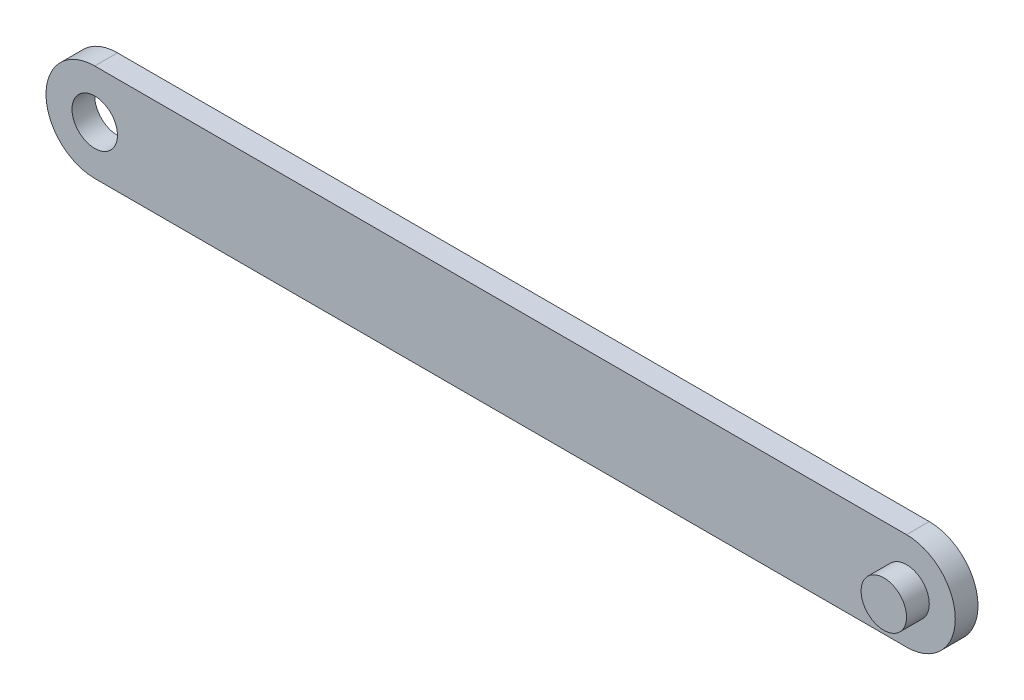
ISO-10303-21;
HEADER;
FILE_DESCRIPTION(('STEP AP214'),'2;1');
FILE_NAME('part.step','',(''),(''),'','','');
FILE_SCHEMA(('AUTOMOTIVE_DESIGN { 1 0 10303 214 1 1 1 1 }'));
ENDSEC;
DATA;
#1=APPLICATION_CONTEXT('core data for automotive mechanical design processes');
#2=APPLICATION_PROTOCOL_DEFINITION('international standard','automotive_design',2000,#1);
#3=PRODUCT_CONTEXT('',#1,'mechanical');
#4=PRODUCT('Part','Part','',(#3));
#5=PRODUCT_RELATED_PRODUCT_CATEGORY('part','',(#4));
#6=PRODUCT_DEFINITION_FORMATION('','',#4);
#7=PRODUCT_DEFINITION_CONTEXT('part definition',#1,'design');
#8=PRODUCT_DEFINITION('design','',#6,#7);
#9=PRODUCT_DEFINITION_SHAPE('','',#8);
#10=(LENGTH_UNIT() NAMED_UNIT(*) SI_UNIT(.MILLI.,.METRE.));
#11=(NAMED_UNIT(*) PLANE_ANGLE_UNIT() SI_UNIT($,.RADIAN.));
#12=(NAMED_UNIT(*) SI_UNIT($,.STERADIAN.) SOLID_ANGLE_UNIT());
#13=UNCERTAINTY_MEASURE_WITH_UNIT(LENGTH_MEASURE(1.E-05),#10,'distance_accuracy_value','');
#14=(GEOMETRIC_REPRESENTATION_CONTEXT(3) GLOBAL_UNCERTAINTY_ASSIGNED_CONTEXT((#13)) GLOBAL_UNIT_ASSIGNED_CONTEXT((#10,
#11,#12)) REPRESENTATION_CONTEXT('',''));
#15=CARTESIAN_POINT('',(0.,0.,0.));
#16=DIRECTION('',(0.,0.,1.));
#17=DIRECTION('',(1.,0.,0.));
#18=AXIS2_PLACEMENT_3D('',#15,#16,#17);
#19=CARTESIAN_POINT('',(-125.,0.,7.));
#20=DIRECTION('',(0.,0.,-1.));
#21=DIRECTION('',(-1.,0.,0.));
#22=AXIS2_PLACEMENT_3D('',#19,#20,#21);
#23=CYLINDRICAL_SURFACE('',#22,15.);
#24=CARTESIAN_POINT('',(-125.,0.,0.));
#25=DIRECTION('',(0.,0.,1.));
#26=DIRECTION('',(1.,0.,0.));
#27=AXIS2_PLACEMENT_3D('',#24,#25,#26);
#28=CIRCLE('',#27,15.);
#29=CARTESIAN_POINT('',(-125.,15.,0.));
#30=VERTEX_POINT('',#29);
#31=CARTESIAN_POINT('',(-125.,-15.,0.));
#32=VERTEX_POINT('',#31);
#33=EDGE_CURVE('E96',#30,#32,#28,.T.);
#34=ORIENTED_EDGE('',*,*,#33,.T.);
#35=DIRECTION('',(0.,0.,-1.));
#36=VECTOR('',#35,1.);
#37=CARTESIAN_POINT('',(-125.,-15.,7.));
#38=LINE('',#37,#36);
#39=CARTESIAN_POINT('',(-125.,-15.,7.));
#40=VERTEX_POINT('',#39);
#41=EDGE_CURVE('E11',#40,#32,#38,.T.);
#42=ORIENTED_EDGE('',*,*,#41,.F.);
#43=CARTESIAN_POINT('',(-125.,0.,7.));
#44=DIRECTION('',(0.,0.,1.));
#45=DIRECTION('',(1.,0.,0.));
#46=AXIS2_PLACEMENT_3D('',#43,#44,#45);
#47=CIRCLE('',#46,15.);
#48=CARTESIAN_POINT('',(-125.,15.,7.));
#49=VERTEX_POINT('',#48);
#50=EDGE_CURVE('E84',#49,#40,#47,.T.);
#51=ORIENTED_EDGE('',*,*,#50,.F.);
#52=DIRECTION('',(0.,0.,-1.));
#53=VECTOR('',#52,1.);
#54=CARTESIAN_POINT('',(-125.,15.,7.));
#55=LINE('',#54,#53);
#56=EDGE_CURVE('E92',#49,#30,#55,.T.);
#57=ORIENTED_EDGE('',*,*,#56,.T.);
#58=EDGE_LOOP('',(#34,#42,#51,#57));
#59=FACE_BOUND('',#58,.T.);
#60=ADVANCED_FACE('F33',(#59),#23,.T.);
#61=CARTESIAN_POINT('',(-125.,-15.,7.));
#62=DIRECTION('',(0.,1.,0.));
#63=DIRECTION('',(-1.,0.,0.));
#64=AXIS2_PLACEMENT_3D('',#61,#62,#63);
#65=PLANE('',#64);
#66=DIRECTION('',(1.,0.,0.));
#67=VECTOR('',#66,1.);
#68=CARTESIAN_POINT('',(-125.,-15.,0.));
#69=LINE('',#68,#67);
#70=CARTESIAN_POINT('',(125.,-15.,0.));
#71=VERTEX_POINT('',#70);
#72=EDGE_CURVE('E88',#32,#71,#69,.T.);
#73=ORIENTED_EDGE('',*,*,#72,.T.);
#74=DIRECTION('',(0.,0.,-1.));
#75=VECTOR('',#74,1.);
#76=CARTESIAN_POINT('',(125.,-15.,7.));
#77=LINE('',#76,#75);
#78=CARTESIAN_POINT('',(125.,-15.,7.));
#79=VERTEX_POINT('',#78);
#80=EDGE_CURVE('E41',#79,#71,#77,.T.);
#81=ORIENTED_EDGE('',*,*,#80,.F.);
#82=DIRECTION('',(1.,0.,0.));
#83=VECTOR('',#82,1.);
#84=CARTESIAN_POINT('',(-125.,-15.,7.));
#85=LINE('',#84,#83);
#86=EDGE_CURVE('E79',#40,#79,#85,.T.);
#87=ORIENTED_EDGE('',*,*,#86,.F.);
#88=ORIENTED_EDGE('',*,*,#41,.T.);
#89=EDGE_LOOP('',(#73,#81,#87,#88));
#90=FACE_BOUND('',#89,.T.);
#91=ADVANCED_FACE('F87',(#90),#65,.F.);
#92=CARTESIAN_POINT('',(125.,0.,7.));
#93=DIRECTION('',(0.,0.,-1.));
#94=DIRECTION('',(-1.,0.,0.));
#95=AXIS2_PLACEMENT_3D('',#92,#93,#94);
#96=CYLINDRICAL_SURFACE('',#95,15.);
#97=CARTESIAN_POINT('',(125.,0.,0.));
#98=DIRECTION('',(0.,0.,1.));
#99=DIRECTION('',(1.,0.,0.));
#100=AXIS2_PLACEMENT_3D('',#97,#98,#99);
#101=CIRCLE('',#100,15.);
#102=CARTESIAN_POINT('',(125.,15.,0.));
#103=VERTEX_POINT('',#102);
#104=EDGE_CURVE('E66',#71,#103,#101,.T.);
#105=ORIENTED_EDGE('',*,*,#104,.T.);
#106=DIRECTION('',(0.,0.,-1.));
#107=VECTOR('',#106,1.);
#108=CARTESIAN_POINT('',(125.,15.,7.));
#109=LINE('',#108,#107);
#110=CARTESIAN_POINT('',(125.,15.,7.));
#111=VERTEX_POINT('',#110);
#112=EDGE_CURVE('E89',#111,#103,#109,.T.);
#113=ORIENTED_EDGE('',*,*,#112,.F.);
#114=CARTESIAN_POINT('',(125.,0.,7.));
#115=DIRECTION('',(0.,0.,1.));
#116=DIRECTION('',(1.,0.,0.));
#117=AXIS2_PLACEMENT_3D('',#114,#115,#116);
#118=CIRCLE('',#117,15.);
#119=EDGE_CURVE('E82',#79,#111,#118,.T.);
#120=ORIENTED_EDGE('',*,*,#119,.F.);
#121=ORIENTED_EDGE('',*,*,#80,.T.);
#122=EDGE_LOOP('',(#105,#113,#120,#121));
#123=FACE_BOUND('',#122,.T.);
#124=ADVANCED_FACE('F90',(#123),#96,.T.);
#125=CARTESIAN_POINT('',(-125.,15.,7.));
#126=DIRECTION('',(0.,-1.,0.));
#127=DIRECTION('',(0.,0.,-1.));
#128=AXIS2_PLACEMENT_3D('',#125,#126,#127);
#129=PLANE('',#128);
#130=DIRECTION('',(-1.,0.,0.));
#131=VECTOR('',#130,1.);
#132=CARTESIAN_POINT('',(-125.,15.,0.));
#133=LINE('',#132,#131);
#134=EDGE_CURVE('E72',#103,#30,#133,.T.);
#135=ORIENTED_EDGE('',*,*,#134,.T.);
#136=ORIENTED_EDGE('',*,*,#56,.F.);
#137=DIRECTION('',(-1.,0.,0.));
#138=VECTOR('',#137,1.);
#139=CARTESIAN_POINT('',(-125.,15.,7.));
#140=LINE('',#139,#138);
#141=EDGE_CURVE('E49',#111,#49,#140,.T.);
#142=ORIENTED_EDGE('',*,*,#141,.F.);
#143=ORIENTED_EDGE('',*,*,#112,.T.);
#144=EDGE_LOOP('',(#135,#136,#142,#143));
#145=FACE_BOUND('',#144,.T.);
#146=ADVANCED_FACE('F104',(#145),#129,.F.);
#147=CARTESIAN_POINT('',(-125.,0.,7.));
#148=DIRECTION('',(0.,0.,1.));
#149=DIRECTION('',(1.,0.,0.));
#150=AXIS2_PLACEMENT_3D('',#147,#148,#149);
#151=PLANE('',#150);
#152=CARTESIAN_POINT('',(-125.,0.,7.));
#153=DIRECTION('',(0.,0.,1.));
#154=DIRECTION('',(1.,0.,0.));
#155=AXIS2_PLACEMENT_3D('',#152,#153,#154);
#156=CIRCLE('',#155,7.);
#157=CARTESIAN_POINT('',(-118.,0.,7.));
#158=VERTEX_POINT('',#157);
#159=EDGE_CURVE('E116',#158,#158,#156,.T.);
#160=ORIENTED_EDGE('',*,*,#159,.F.);
#161=EDGE_LOOP('',(#160));
#162=FACE_BOUND('',#161,.T.);
#163=CARTESIAN_POINT('',(125.,0.,7.));
#164=DIRECTION('',(0.,0.,1.));
#165=DIRECTION('',(1.,0.,0.));
#166=AXIS2_PLACEMENT_3D('',#163,#164,#165);
#167=CIRCLE('',#166,7.00000000000001);
#168=CARTESIAN_POINT('',(132.,0.,7.));
#169=VERTEX_POINT('',#168);
#170=EDGE_CURVE('E110',#169,#169,#167,.T.);
#171=ORIENTED_EDGE('',*,*,#170,.F.);
#172=EDGE_LOOP('',(#171));
#173=FACE_BOUND('',#172,.T.);
#174=ORIENTED_EDGE('',*,*,#50,.T.);
#175=ORIENTED_EDGE('',*,*,#86,.T.);
#176=ORIENTED_EDGE('',*,*,#119,.T.);
#177=ORIENTED_EDGE('',*,*,#141,.T.);
#178=EDGE_LOOP('',(#174,#175,#176,#177));
#179=FACE_BOUND('',#178,.T.);
#180=ADVANCED_FACE('F80',(#162,#173,#179),#151,.T.);
#181=CARTESIAN_POINT('',(-125.,0.,0.));
#182=DIRECTION('',(0.,0.,1.));
#183=DIRECTION('',(1.,0.,0.));
#184=AXIS2_PLACEMENT_3D('',#181,#182,#183);
#185=PLANE('',#184);
#186=CARTESIAN_POINT('',(-125.,0.,0.));
#187=DIRECTION('',(0.,0.,1.));
#188=DIRECTION('',(1.,0.,0.));
#189=AXIS2_PLACEMENT_3D('',#186,#187,#188);
#190=CIRCLE('',#189,7.);
#191=CARTESIAN_POINT('',(-118.,0.,0.));
#192=VERTEX_POINT('',#191);
#193=EDGE_CURVE('E113',#192,#192,#190,.T.);
#194=ORIENTED_EDGE('',*,*,#193,.T.);
#195=EDGE_LOOP('',(#194));
#196=FACE_BOUND('',#195,.T.);
#197=ORIENTED_EDGE('',*,*,#33,.F.);
#198=ORIENTED_EDGE('',*,*,#134,.F.);
#199=ORIENTED_EDGE('',*,*,#104,.F.);
#200=ORIENTED_EDGE('',*,*,#72,.F.);
#201=EDGE_LOOP('',(#197,#198,#199,#200));
#202=FACE_BOUND('',#201,.T.);
#203=ADVANCED_FACE('F107',(#196,#202),#185,.F.);
#204=CARTESIAN_POINT('',(125.,0.,14.));
#205=DIRECTION('',(0.,0.,-1.));
#206=DIRECTION('',(-1.,0.,0.));
#207=AXIS2_PLACEMENT_3D('',#204,#205,#206);
#208=CYLINDRICAL_SURFACE('',#207,7.00000000000001);
#209=CARTESIAN_POINT('',(125.,0.,14.));
#210=DIRECTION('',(0.,0.,1.));
#211=DIRECTION('',(1.,0.,0.));
#212=AXIS2_PLACEMENT_3D('',#209,#210,#211);
#213=CIRCLE('',#212,7.00000000000001);
#214=CARTESIAN_POINT('',(132.,0.,14.));
#215=VERTEX_POINT('',#214);
#216=EDGE_CURVE('E99',#215,#215,#213,.T.);
#217=ORIENTED_EDGE('',*,*,#216,.F.);
#218=EDGE_LOOP('',(#217));
#219=FACE_BOUND('',#218,.T.);
#220=ORIENTED_EDGE('',*,*,#170,.T.);
#221=EDGE_LOOP('',(#220));
#222=FACE_BOUND('',#221,.T.);
#223=ADVANCED_FACE('F135',(#219,#222),#208,.T.);
#224=CARTESIAN_POINT('',(125.,0.,14.));
#225=DIRECTION('',(0.,0.,1.));
#226=DIRECTION('',(1.,0.,0.));
#227=AXIS2_PLACEMENT_3D('',#224,#225,#226);
#228=PLANE('',#227);
#229=ORIENTED_EDGE('',*,*,#216,.T.);
#230=EDGE_LOOP('',(#229));
#231=FACE_BOUND('',#230,.T.);
#232=ADVANCED_FACE('F126',(#231),#228,.T.);
#233=CARTESIAN_POINT('',(-125.,0.,0.));
#234=DIRECTION('',(0.,0.,1.));
#235=DIRECTION('',(1.,0.,0.));
#236=AXIS2_PLACEMENT_3D('',#233,#234,#235);
#237=CYLINDRICAL_SURFACE('',#236,7.);
#238=ORIENTED_EDGE('',*,*,#193,.F.);
#239=EDGE_LOOP('',(#238));
#240=FACE_BOUND('',#239,.T.);
#241=ORIENTED_EDGE('',*,*,#159,.T.);
#242=EDGE_LOOP('',(#241));
#243=FACE_BOUND('',#242,.T.);
#244=ADVANCED_FACE('F123',(#240,#243),#237,.F.);
#245=CLOSED_SHELL('',(#60,#91,#124,#146,#180,#203,#223,#232,#244));
#246=MANIFOLD_SOLID_BREP('B2',#245);
#247=ADVANCED_BREP_SHAPE_REPRESENTATION('',(#18,#246),#14);
#248=SHAPE_DEFINITION_REPRESENTATION(#9,#247);
ENDSEC;
END-ISO-10303-21;
